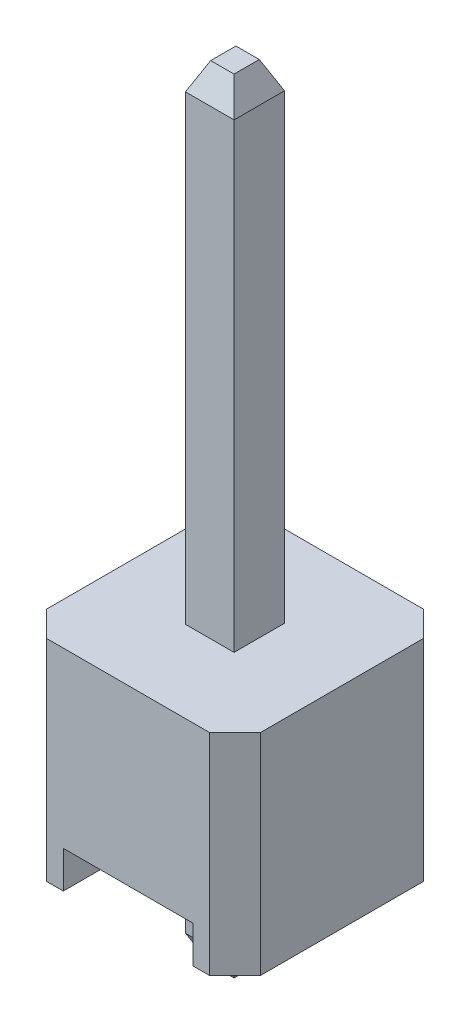
ISO-10303-21;
HEADER;
FILE_DESCRIPTION(('STEP AP214'),'2;1');
FILE_NAME('part.step','',(''),(''),'','','');
FILE_SCHEMA(('AUTOMOTIVE_DESIGN { 1 0 10303 214 1 1 1 1 }'));
ENDSEC;
DATA;
#1=APPLICATION_CONTEXT('core data for automotive mechanical design processes');
#2=APPLICATION_PROTOCOL_DEFINITION('international standard','automotive_design',2000,#1);
#3=PRODUCT_CONTEXT('',#1,'mechanical');
#4=PRODUCT('Part','Part','',(#3));
#5=PRODUCT_RELATED_PRODUCT_CATEGORY('part','',(#4));
#6=PRODUCT_DEFINITION_FORMATION('','',#4);
#7=PRODUCT_DEFINITION_CONTEXT('part definition',#1,'design');
#8=PRODUCT_DEFINITION('design','',#6,#7);
#9=PRODUCT_DEFINITION_SHAPE('','',#8);
#10=(LENGTH_UNIT() NAMED_UNIT(*) SI_UNIT(.MILLI.,.METRE.));
#11=(NAMED_UNIT(*) PLANE_ANGLE_UNIT() SI_UNIT($,.RADIAN.));
#12=(NAMED_UNIT(*) SI_UNIT($,.STERADIAN.) SOLID_ANGLE_UNIT());
#13=UNCERTAINTY_MEASURE_WITH_UNIT(LENGTH_MEASURE(1.E-05),#10,'distance_accuracy_value','');
#14=(GEOMETRIC_REPRESENTATION_CONTEXT(3) GLOBAL_UNCERTAINTY_ASSIGNED_CONTEXT((#13)) GLOBAL_UNIT_ASSIGNED_CONTEXT((#10,
#11,#12)) REPRESENTATION_CONTEXT('',''));
#15=CARTESIAN_POINT('',(0.,0.,0.));
#16=DIRECTION('',(0.,0.,1.));
#17=DIRECTION('',(1.,0.,0.));
#18=AXIS2_PLACEMENT_3D('',#15,#16,#17);
#19=CARTESIAN_POINT('',(-19.1812561045914,-5.69124998633488,0.951627111171994));
#20=DIRECTION('',(0.,-1.,0.));
#21=DIRECTION('',(0.,0.,-1.));
#22=AXIS2_PLACEMENT_3D('',#19,#20,#21);
#23=PLANE('',#22);
#24=DIRECTION('',(0.,0.,1.));
#25=VECTOR('',#24,1.);
#26=CARTESIAN_POINT('',(-19.0312561045914,-5.69124998633488,1.55162711117199));
#27=LINE('',#26,#25);
#28=CARTESIAN_POINT('',(-19.0312561045914,-5.69124998633488,1.40162711117199));
#29=VERTEX_POINT('',#28);
#30=CARTESIAN_POINT('',(-19.0312561045914,-5.69124998633488,1.10162711117199));
#31=VERTEX_POINT('',#30);
#32=EDGE_CURVE('E193',#29,#31,#27,.F.);
#33=ORIENTED_EDGE('',*,*,#32,.T.);
#34=DIRECTION('',(1.,0.,0.));
#35=VECTOR('',#34,1.);
#36=CARTESIAN_POINT('',(-19.1812561045914,-5.69124998633488,1.10162711117199));
#37=LINE('',#36,#35);
#38=CARTESIAN_POINT('',(-18.7537499744834,-5.69124998633488,1.10162711117199));
#39=VERTEX_POINT('',#38);
#40=EDGE_CURVE('E178',#31,#39,#37,.T.);
#41=ORIENTED_EDGE('',*,*,#40,.T.);
#42=DIRECTION('',(0.,0.,1.));
#43=VECTOR('',#42,1.);
#44=CARTESIAN_POINT('',(-18.7537499744834,-5.69124998633488,0.951627111171994));
#45=LINE('',#44,#43);
#46=CARTESIAN_POINT('',(-18.7537499744834,-5.69124998633488,1.40162711117199));
#47=VERTEX_POINT('',#46);
#48=EDGE_CURVE('E19',#39,#47,#45,.T.);
#49=ORIENTED_EDGE('',*,*,#48,.T.);
#50=DIRECTION('',(1.,0.,0.));
#51=VECTOR('',#50,1.);
#52=CARTESIAN_POINT('',(-18.6037499744834,-5.69124998633488,1.40162711117199));
#53=LINE('',#52,#51);
#54=EDGE_CURVE('E173',#47,#29,#53,.F.);
#55=ORIENTED_EDGE('',*,*,#54,.T.);
#56=EDGE_LOOP('',(#33,#41,#49,#55));
#57=FACE_BOUND('',#56,.T.);
#58=ADVANCED_FACE('F16',(#57),#23,.T.);
#59=CARTESIAN_POINT('',(-18.6037499744834,-5.36957394825845,0.951627111171994));
#60=DIRECTION('',(-0.90630778703665,0.4226182617407,0.));
#61=DIRECTION('',(-0.4226182617407,-0.90630778703665,0.));
#62=AXIS2_PLACEMENT_3D('',#59,#60,#61);
#63=PLANE('',#62);
#64=DIRECTION('',(0.,0.,-1.));
#65=VECTOR('',#64,1.);
#66=CARTESIAN_POINT('',(-18.6037499744834,-5.36957394825845,0.951627111171994));
#67=LINE('',#66,#65);
#68=CARTESIAN_POINT('',(-18.6037499744834,-5.36957394825845,1.55162711117199));
#69=VERTEX_POINT('',#68);
#70=CARTESIAN_POINT('',(-18.6037499744834,-5.36957394825845,0.951627111171994));
#71=VERTEX_POINT('',#70);
#72=EDGE_CURVE('E185',#69,#71,#67,.T.);
#73=ORIENTED_EDGE('',*,*,#72,.F.);
#74=DIRECTION('',(-0.389281620635035,-0.834817129478983,-0.389281620635025));
#75=VECTOR('',#74,1.);
#76=CARTESIAN_POINT('',(-18.6037499744834,-5.36957394825845,1.55162711117199));
#77=LINE('',#76,#75);
#78=EDGE_CURVE('E181',#69,#47,#77,.T.);
#79=ORIENTED_EDGE('',*,*,#78,.T.);
#80=ORIENTED_EDGE('',*,*,#48,.F.);
#81=DIRECTION('',(0.389281620635035,0.834817129478983,-0.389281620635025));
#82=VECTOR('',#81,1.);
#83=CARTESIAN_POINT('',(-18.7537499744834,-5.69124998633488,1.10162711117199));
#84=LINE('',#83,#82);
#85=EDGE_CURVE('E201',#39,#71,#84,.T.);
#86=ORIENTED_EDGE('',*,*,#85,.T.);
#87=EDGE_LOOP('',(#73,#79,#80,#86));
#88=FACE_BOUND('',#87,.T.);
#89=ADVANCED_FACE('F183',(#88),#63,.F.);
#90=CARTESIAN_POINT('',(-18.6037499744834,-5.36957394825845,1.55162711117199));
#91=DIRECTION('',(0.,0.422618261740701,-0.906307787036649));
#92=DIRECTION('',(0.,0.906307787036649,0.422618261740701));
#93=AXIS2_PLACEMENT_3D('',#90,#91,#92);
#94=PLANE('',#93);
#95=ORIENTED_EDGE('',*,*,#54,.F.);
#96=ORIENTED_EDGE('',*,*,#78,.F.);
#97=DIRECTION('',(1.,0.,0.));
#98=VECTOR('',#97,1.);
#99=CARTESIAN_POINT('',(-18.6037499744834,-5.36957394825845,1.55162711117199));
#100=LINE('',#99,#98);
#101=CARTESIAN_POINT('',(-19.1812561045914,-5.36957394825845,1.55162711117199));
#102=VERTEX_POINT('',#101);
#103=EDGE_CURVE('E204',#102,#69,#100,.T.);
#104=ORIENTED_EDGE('',*,*,#103,.F.);
#105=DIRECTION('',(0.389281620635027,-0.834817129478987,-0.389281620635025));
#106=VECTOR('',#105,1.);
#107=CARTESIAN_POINT('',(-19.1812561045914,-5.36957394825845,1.55162711117199));
#108=LINE('',#107,#106);
#109=EDGE_CURVE('E190',#102,#29,#108,.T.);
#110=ORIENTED_EDGE('',*,*,#109,.T.);
#111=EDGE_LOOP('',(#95,#96,#104,#110));
#112=FACE_BOUND('',#111,.T.);
#113=ADVANCED_FACE('F188',(#112),#94,.F.);
#114=CARTESIAN_POINT('',(-19.1812561045914,-5.36957394825845,1.55162711117199));
#115=DIRECTION('',(0.906307787036649,0.422618261740701,0.));
#116=DIRECTION('',(-0.422618261740701,0.906307787036649,0.));
#117=AXIS2_PLACEMENT_3D('',#114,#115,#116);
#118=PLANE('',#117);
#119=ORIENTED_EDGE('',*,*,#32,.F.);
#120=ORIENTED_EDGE('',*,*,#109,.F.);
#121=DIRECTION('',(0.,0.,1.));
#122=VECTOR('',#121,1.);
#123=CARTESIAN_POINT('',(-19.1812561045914,-5.36957394825845,1.55162711117199));
#124=LINE('',#123,#122);
#125=CARTESIAN_POINT('',(-19.1812561045914,-5.36957394825845,0.951627111171994));
#126=VERTEX_POINT('',#125);
#127=EDGE_CURVE('E210',#126,#102,#124,.T.);
#128=ORIENTED_EDGE('',*,*,#127,.F.);
#129=DIRECTION('',(0.389281620635027,-0.834817129478986,0.389281620635026));
#130=VECTOR('',#129,1.);
#131=CARTESIAN_POINT('',(-19.1812561045914,-5.36957394825845,0.951627111171994));
#132=LINE('',#131,#130);
#133=EDGE_CURVE('E197',#126,#31,#132,.T.);
#134=ORIENTED_EDGE('',*,*,#133,.T.);
#135=EDGE_LOOP('',(#119,#120,#128,#134));
#136=FACE_BOUND('',#135,.T.);
#137=ADVANCED_FACE('F517',(#136),#118,.F.);
#138=CARTESIAN_POINT('',(-19.1812561045914,-5.36957394825845,0.951627111171994));
#139=DIRECTION('',(0.,0.422618261740701,0.906307787036649));
#140=DIRECTION('',(0.,-0.906307787036649,0.422618261740701));
#141=AXIS2_PLACEMENT_3D('',#138,#139,#140);
#142=PLANE('',#141);
#143=ORIENTED_EDGE('',*,*,#40,.F.);
#144=ORIENTED_EDGE('',*,*,#133,.F.);
#145=DIRECTION('',(-1.,0.,0.));
#146=VECTOR('',#145,1.);
#147=CARTESIAN_POINT('',(-19.1812561045914,-5.36957394825845,0.951627111171994));
#148=LINE('',#147,#146);
#149=EDGE_CURVE('E219',#71,#126,#148,.T.);
#150=ORIENTED_EDGE('',*,*,#149,.F.);
#151=ORIENTED_EDGE('',*,*,#85,.F.);
#152=EDGE_LOOP('',(#143,#144,#150,#151));
#153=FACE_BOUND('',#152,.T.);
#154=ADVANCED_FACE('F513',(#153),#142,.F.);
#155=CARTESIAN_POINT('',(-18.6037499744834,-5.69124998633488,0.951627111171994));
#156=DIRECTION('',(1.,0.,0.));
#157=DIRECTION('',(0.,0.,-1.));
#158=AXIS2_PLACEMENT_3D('',#155,#156,#157);
#159=PLANE('',#158);
#160=DIRECTION('',(0.,1.,0.));
#161=VECTOR('',#160,1.);
#162=CARTESIAN_POINT('',(-18.6037499744834,-5.69124998633488,0.951627111171994));
#163=LINE('',#162,#161);
#164=CARTESIAN_POINT('',(-18.6037499744834,-4.25124998633488,0.951627111171994));
#165=VERTEX_POINT('',#164);
#166=EDGE_CURVE('E216',#165,#71,#163,.F.);
#167=ORIENTED_EDGE('',*,*,#166,.F.);
#168=DIRECTION('',(0.,0.,1.));
#169=VECTOR('',#168,1.);
#170=CARTESIAN_POINT('',(-18.6037499744834,-4.25124998633488,2.52162711117199));
#171=LINE('',#170,#169);
#172=CARTESIAN_POINT('',(-18.6037499744834,-4.25124998633488,1.55162711117199));
#173=VERTEX_POINT('',#172);
#174=EDGE_CURVE('E229',#165,#173,#171,.T.);
#175=ORIENTED_EDGE('',*,*,#174,.T.);
#176=DIRECTION('',(0.,1.,0.));
#177=VECTOR('',#176,1.);
#178=CARTESIAN_POINT('',(-18.6037499744834,-5.69124998633488,1.55162711117199));
#179=LINE('',#178,#177);
#180=EDGE_CURVE('E207',#69,#173,#179,.T.);
#181=ORIENTED_EDGE('',*,*,#180,.F.);
#182=ORIENTED_EDGE('',*,*,#72,.T.);
#183=EDGE_LOOP('',(#167,#175,#181,#182));
#184=FACE_BOUND('',#183,.T.);
#185=ADVANCED_FACE('F509',(#184),#159,.T.);
#186=CARTESIAN_POINT('',(-18.6037499744834,-5.69124998633488,1.55162711117199));
#187=DIRECTION('',(0.,0.,1.));
#188=DIRECTION('',(1.,0.,0.));
#189=AXIS2_PLACEMENT_3D('',#186,#187,#188);
#190=PLANE('',#189);
#191=ORIENTED_EDGE('',*,*,#180,.T.);
#192=DIRECTION('',(1.,0.,0.));
#193=VECTOR('',#192,1.);
#194=CARTESIAN_POINT('',(-18.1225030395374,-4.25124998633488,1.55162711117199));
#195=LINE('',#194,#193);
#196=CARTESIAN_POINT('',(-19.1812561045914,-4.25124998633488,1.55162711117199));
#197=VERTEX_POINT('',#196);
#198=EDGE_CURVE('E231',#173,#197,#195,.F.);
#199=ORIENTED_EDGE('',*,*,#198,.T.);
#200=DIRECTION('',(0.,1.,0.));
#201=VECTOR('',#200,1.);
#202=CARTESIAN_POINT('',(-19.1812561045914,-5.69124998633488,1.55162711117199));
#203=LINE('',#202,#201);
#204=EDGE_CURVE('E213',#102,#197,#203,.T.);
#205=ORIENTED_EDGE('',*,*,#204,.F.);
#206=ORIENTED_EDGE('',*,*,#103,.T.);
#207=EDGE_LOOP('',(#191,#199,#205,#206));
#208=FACE_BOUND('',#207,.T.);
#209=ADVANCED_FACE('F505',(#208),#190,.T.);
#210=CARTESIAN_POINT('',(-19.1812561045914,-5.69124998633488,1.55162711117199));
#211=DIRECTION('',(-1.,0.,0.));
#212=DIRECTION('',(0.,0.,1.));
#213=AXIS2_PLACEMENT_3D('',#210,#211,#212);
#214=PLANE('',#213);
#215=ORIENTED_EDGE('',*,*,#204,.T.);
#216=DIRECTION('',(0.,0.,1.));
#217=VECTOR('',#216,1.);
#218=CARTESIAN_POINT('',(-19.1812561045914,-4.25124998633488,2.52162711117199));
#219=LINE('',#218,#217);
#220=CARTESIAN_POINT('',(-19.1812561045914,-4.25124998633488,0.951627111171994));
#221=VERTEX_POINT('',#220);
#222=EDGE_CURVE('E233',#197,#221,#219,.F.);
#223=ORIENTED_EDGE('',*,*,#222,.T.);
#224=DIRECTION('',(0.,1.,0.));
#225=VECTOR('',#224,1.);
#226=CARTESIAN_POINT('',(-19.1812561045914,-5.69124998633488,0.951627111171994));
#227=LINE('',#226,#225);
#228=EDGE_CURVE('E222',#126,#221,#227,.T.);
#229=ORIENTED_EDGE('',*,*,#228,.F.);
#230=ORIENTED_EDGE('',*,*,#127,.T.);
#231=EDGE_LOOP('',(#215,#223,#229,#230));
#232=FACE_BOUND('',#231,.T.);
#233=ADVANCED_FACE('F501',(#232),#214,.T.);
#234=CARTESIAN_POINT('',(-19.1812561045914,-5.69124998633488,0.951627111171994));
#235=DIRECTION('',(0.,0.,-1.));
#236=DIRECTION('',(-1.,0.,0.));
#237=AXIS2_PLACEMENT_3D('',#234,#235,#236);
#238=PLANE('',#237);
#239=ORIENTED_EDGE('',*,*,#228,.T.);
#240=DIRECTION('',(1.,0.,0.));
#241=VECTOR('',#240,1.);
#242=CARTESIAN_POINT('',(-18.1225030395374,-4.25124998633488,0.951627111171994));
#243=LINE('',#242,#241);
#244=EDGE_CURVE('E235',#221,#165,#243,.T.);
#245=ORIENTED_EDGE('',*,*,#244,.T.);
#246=ORIENTED_EDGE('',*,*,#166,.T.);
#247=ORIENTED_EDGE('',*,*,#149,.T.);
#248=EDGE_LOOP('',(#239,#245,#246,#247));
#249=FACE_BOUND('',#248,.T.);
#250=ADVANCED_FACE('F497',(#249),#238,.T.);
#251=CARTESIAN_POINT('',(-18.1225030395374,-4.25124998633488,2.52162711117199));
#252=DIRECTION('',(0.,1.,0.));
#253=DIRECTION('',(0.,0.,1.));
#254=AXIS2_PLACEMENT_3D('',#251,#252,#253);
#255=PLANE('',#254);
#256=ORIENTED_EDGE('',*,*,#222,.F.);
#257=ORIENTED_EDGE('',*,*,#198,.F.);
#258=ORIENTED_EDGE('',*,*,#174,.F.);
#259=ORIENTED_EDGE('',*,*,#244,.F.);
#260=EDGE_LOOP('',(#256,#257,#258,#259));
#261=FACE_BOUND('',#260,.T.);
#262=DIRECTION('',(0.,0.,1.));
#263=VECTOR('',#262,1.);
#264=CARTESIAN_POINT('',(-19.6625030395374,-4.25124998633488,2.52162711117199));
#265=LINE('',#264,#263);
#266=CARTESIAN_POINT('',(-19.6625030395374,-4.25124998633488,2.52162711117199));
#267=VERTEX_POINT('',#266);
#268=CARTESIAN_POINT('',(-19.6625030395374,-4.25124998633488,-0.0183728888280069));
#269=VERTEX_POINT('',#268);
#270=EDGE_CURVE('E240',#267,#269,#265,.F.);
#271=ORIENTED_EDGE('',*,*,#270,.T.);
#272=DIRECTION('',(1.,0.,0.));
#273=VECTOR('',#272,1.);
#274=CARTESIAN_POINT('',(-18.1225030395374,-4.25124998633488,-0.0183728888280069));
#275=LINE('',#274,#273);
#276=CARTESIAN_POINT('',(-18.1225030395374,-4.25124998633488,-0.0183728888280069));
#277=VERTEX_POINT('',#276);
#278=EDGE_CURVE('E225',#277,#269,#275,.F.);
#279=ORIENTED_EDGE('',*,*,#278,.F.);
#280=DIRECTION('',(0.,0.,-1.));
#281=VECTOR('',#280,1.);
#282=CARTESIAN_POINT('',(-18.1225030395374,-4.25124998633488,2.52162711117199));
#283=LINE('',#282,#281);
#284=CARTESIAN_POINT('',(-18.1225030395374,-4.25124998633488,2.52162711117199));
#285=VERTEX_POINT('',#284);
#286=EDGE_CURVE('E247',#277,#285,#283,.F.);
#287=ORIENTED_EDGE('',*,*,#286,.T.);
#288=DIRECTION('',(1.,0.,0.));
#289=VECTOR('',#288,1.);
#290=CARTESIAN_POINT('',(-18.1225030395374,-4.25124998633488,2.52162711117199));
#291=LINE('',#290,#289);
#292=EDGE_CURVE('E227',#267,#285,#291,.T.);
#293=ORIENTED_EDGE('',*,*,#292,.F.);
#294=EDGE_LOOP('',(#271,#279,#287,#293));
#295=FACE_BOUND('',#294,.T.);
#296=ADVANCED_FACE('F494',(#261,#295),#255,.F.);
#297=CARTESIAN_POINT('',(-19.1812561045914,3.60875001366512,1.10162711117199));
#298=DIRECTION('',(0.,0.422618261740697,-0.906307787036651));
#299=DIRECTION('',(0.,0.906307787036651,0.422618261740697));
#300=AXIS2_PLACEMENT_3D('',#297,#298,#299);
#301=PLANE('',#300);
#302=DIRECTION('',(-0.389281620635024,-0.83481712947899,-0.389281620635022));
#303=VECTOR('',#302,1.);
#304=CARTESIAN_POINT('',(-19.0312561045914,3.60875001366512,1.10162711117199));
#305=LINE('',#304,#303);
#306=CARTESIAN_POINT('',(-19.0312561045914,3.60875001366512,1.10162711117199));
#307=VERTEX_POINT('',#306);
#308=CARTESIAN_POINT('',(-19.1812561045914,3.28707397558869,0.951627111171994));
#309=VERTEX_POINT('',#308);
#310=EDGE_CURVE('E262',#307,#309,#305,.T.);
#311=ORIENTED_EDGE('',*,*,#310,.F.);
#312=DIRECTION('',(1.,0.,0.));
#313=VECTOR('',#312,1.);
#314=CARTESIAN_POINT('',(-19.1812561045914,3.60875001366512,1.10162711117199));
#315=LINE('',#314,#313);
#316=CARTESIAN_POINT('',(-18.7537499744834,3.60875001366512,1.10162711117199));
#317=VERTEX_POINT('',#316);
#318=EDGE_CURVE('E255',#307,#317,#315,.T.);
#319=ORIENTED_EDGE('',*,*,#318,.T.);
#320=DIRECTION('',(-0.389281620635023,0.83481712947899,0.389281620635021));
#321=VECTOR('',#320,1.);
#322=CARTESIAN_POINT('',(-18.6037499744834,3.28707397558868,0.951627111171994));
#323=LINE('',#322,#321);
#324=CARTESIAN_POINT('',(-18.6037499744834,3.28707397558869,0.951627111171994));
#325=VERTEX_POINT('',#324);
#326=EDGE_CURVE('E252',#325,#317,#323,.T.);
#327=ORIENTED_EDGE('',*,*,#326,.F.);
#328=DIRECTION('',(-1.,0.,0.));
#329=VECTOR('',#328,1.);
#330=CARTESIAN_POINT('',(-19.1812561045914,3.28707397558869,0.951627111171994));
#331=LINE('',#330,#329);
#332=EDGE_CURVE('E265',#309,#325,#331,.F.);
#333=ORIENTED_EDGE('',*,*,#332,.F.);
#334=EDGE_LOOP('',(#311,#319,#327,#333));
#335=FACE_BOUND('',#334,.T.);
#336=ADVANCED_FACE('F471',(#335),#301,.T.);
#337=CARTESIAN_POINT('',(-19.6625030395374,-4.25124998633488,2.52162711117199));
#338=DIRECTION('',(-1.,0.,0.));
#339=DIRECTION('',(0.,0.,1.));
#340=AXIS2_PLACEMENT_3D('',#337,#338,#339);
#341=PLANE('',#340);
#342=DIRECTION('',(0.,1.,0.));
#343=VECTOR('',#342,1.);
#344=CARTESIAN_POINT('',(-19.6625030395374,-4.25124998633488,-0.0183728888280069));
#345=LINE('',#344,#343);
#346=CARTESIAN_POINT('',(-19.6625030395374,-4.69124998633488,-0.0183728888280069));
#347=VERTEX_POINT('',#346);
#348=EDGE_CURVE('E243',#269,#347,#345,.F.);
#349=ORIENTED_EDGE('',*,*,#348,.F.);
#350=ORIENTED_EDGE('',*,*,#270,.F.);
#351=DIRECTION('',(0.,1.,0.));
#352=VECTOR('',#351,1.);
#353=CARTESIAN_POINT('',(-19.6625030395374,-4.25124998633488,2.52162711117199));
#354=LINE('',#353,#352);
#355=CARTESIAN_POINT('',(-19.6625030395374,-4.69124998633488,2.52162711117199));
#356=VERTEX_POINT('',#355);
#357=EDGE_CURVE('E238',#356,#267,#354,.T.);
#358=ORIENTED_EDGE('',*,*,#357,.F.);
#359=DIRECTION('',(0.,0.,1.));
#360=VECTOR('',#359,1.);
#361=CARTESIAN_POINT('',(-19.6625030395374,-4.69124998633488,1.25162711117199));
#362=LINE('',#361,#360);
#363=EDGE_CURVE('E272',#356,#347,#362,.F.);
#364=ORIENTED_EDGE('',*,*,#363,.T.);
#365=EDGE_LOOP('',(#349,#350,#358,#364));
#366=FACE_BOUND('',#365,.T.);
#367=ADVANCED_FACE('F487',(#366),#341,.F.);
#368=CARTESIAN_POINT('',(-18.1225030395374,-4.25124998633488,2.52162711117199));
#369=DIRECTION('',(1.,0.,0.));
#370=DIRECTION('',(0.,0.,-1.));
#371=AXIS2_PLACEMENT_3D('',#368,#369,#370);
#372=PLANE('',#371);
#373=DIRECTION('',(0.,1.,0.));
#374=VECTOR('',#373,1.);
#375=CARTESIAN_POINT('',(-18.1225030395374,-4.25124998633488,2.52162711117199));
#376=LINE('',#375,#374);
#377=CARTESIAN_POINT('',(-18.1225030395374,-4.69124998633488,2.52162711117199));
#378=VERTEX_POINT('',#377);
#379=EDGE_CURVE('E250',#285,#378,#376,.F.);
#380=ORIENTED_EDGE('',*,*,#379,.F.);
#381=ORIENTED_EDGE('',*,*,#286,.F.);
#382=DIRECTION('',(0.,1.,0.));
#383=VECTOR('',#382,1.);
#384=CARTESIAN_POINT('',(-18.1225030395374,-4.25124998633488,-0.0183728888280069));
#385=LINE('',#384,#383);
#386=CARTESIAN_POINT('',(-18.1225030395374,-4.69124998633488,-0.018372888828007));
#387=VERTEX_POINT('',#386);
#388=EDGE_CURVE('E245',#387,#277,#385,.T.);
#389=ORIENTED_EDGE('',*,*,#388,.F.);
#390=DIRECTION('',(0.,0.,1.));
#391=VECTOR('',#390,1.);
#392=CARTESIAN_POINT('',(-18.1225030395374,-4.69124998633488,1.25162711117199));
#393=LINE('',#392,#391);
#394=EDGE_CURVE('E287',#387,#378,#393,.T.);
#395=ORIENTED_EDGE('',*,*,#394,.T.);
#396=EDGE_LOOP('',(#380,#381,#389,#395));
#397=FACE_BOUND('',#396,.T.);
#398=ADVANCED_FACE('F481',(#397),#372,.F.);
#399=CARTESIAN_POINT('',(-18.7537499744834,3.60875001366512,0.951627111171993));
#400=DIRECTION('',(0.906307787036651,0.422618261740697,0.));
#401=DIRECTION('',(-0.422618261740697,0.906307787036651,0.));
#402=AXIS2_PLACEMENT_3D('',#399,#400,#401);
#403=PLANE('',#402);
#404=ORIENTED_EDGE('',*,*,#326,.T.);
#405=DIRECTION('',(0.,0.,-1.));
#406=VECTOR('',#405,1.);
#407=CARTESIAN_POINT('',(-18.7537499744834,3.60875001366512,0.951627111171994));
#408=LINE('',#407,#406);
#409=CARTESIAN_POINT('',(-18.7537499744834,3.60875001366512,1.40162711117199));
#410=VERTEX_POINT('',#409);
#411=EDGE_CURVE('E257',#317,#410,#408,.F.);
#412=ORIENTED_EDGE('',*,*,#411,.T.);
#413=DIRECTION('',(-0.389281620635032,0.834817129478986,-0.389281620635021));
#414=VECTOR('',#413,1.);
#415=CARTESIAN_POINT('',(-18.6037499744834,3.28707397558869,1.55162711117199));
#416=LINE('',#415,#414);
#417=CARTESIAN_POINT('',(-18.6037499744834,3.28707397558869,1.55162711117199));
#418=VERTEX_POINT('',#417);
#419=EDGE_CURVE('E309',#418,#410,#416,.T.);
#420=ORIENTED_EDGE('',*,*,#419,.F.);
#421=DIRECTION('',(0.,0.,-1.));
#422=VECTOR('',#421,1.);
#423=CARTESIAN_POINT('',(-18.6037499744834,3.28707397558869,0.951627111171994));
#424=LINE('',#423,#422);
#425=EDGE_CURVE('E302',#325,#418,#424,.F.);
#426=ORIENTED_EDGE('',*,*,#425,.F.);
#427=EDGE_LOOP('',(#404,#412,#420,#426));
#428=FACE_BOUND('',#427,.T.);
#429=ADVANCED_FACE('F465',(#428),#403,.T.);
#430=CARTESIAN_POINT('',(-19.1812561045914,3.60875001366512,0.951627111171994));
#431=DIRECTION('',(0.,-1.,0.));
#432=DIRECTION('',(0.,0.,-1.));
#433=AXIS2_PLACEMENT_3D('',#430,#431,#432);
#434=PLANE('',#433);
#435=ORIENTED_EDGE('',*,*,#318,.F.);
#436=DIRECTION('',(0.,0.,1.));
#437=VECTOR('',#436,1.);
#438=CARTESIAN_POINT('',(-19.0312561045914,3.60875001366512,0.951627111171994));
#439=LINE('',#438,#437);
#440=CARTESIAN_POINT('',(-19.0312561045914,3.60875001366512,1.40162711117199));
#441=VERTEX_POINT('',#440);
#442=EDGE_CURVE('E259',#441,#307,#439,.F.);
#443=ORIENTED_EDGE('',*,*,#442,.F.);
#444=DIRECTION('',(1.,0.,0.));
#445=VECTOR('',#444,1.);
#446=CARTESIAN_POINT('',(-19.1812561045914,3.60875001366512,1.40162711117199));
#447=LINE('',#446,#445);
#448=EDGE_CURVE('E312',#410,#441,#447,.F.);
#449=ORIENTED_EDGE('',*,*,#448,.F.);
#450=ORIENTED_EDGE('',*,*,#411,.F.);
#451=EDGE_LOOP('',(#435,#443,#449,#450));
#452=FACE_BOUND('',#451,.T.);
#453=ADVANCED_FACE('F473',(#452),#434,.F.);
#454=CARTESIAN_POINT('',(-19.0312561045914,3.60875001366512,0.951627111171994));
#455=DIRECTION('',(-0.906307787036651,0.422618261740697,0.));
#456=DIRECTION('',(-0.422618261740697,-0.906307787036651,0.));
#457=AXIS2_PLACEMENT_3D('',#454,#455,#456);
#458=PLANE('',#457);
#459=ORIENTED_EDGE('',*,*,#310,.T.);
#460=DIRECTION('',(0.,0.,1.));
#461=VECTOR('',#460,1.);
#462=CARTESIAN_POINT('',(-19.1812561045914,3.28707397558869,1.55162711117199));
#463=LINE('',#462,#461);
#464=CARTESIAN_POINT('',(-19.1812561045914,3.28707397558869,1.55162711117199));
#465=VERTEX_POINT('',#464);
#466=EDGE_CURVE('E315',#465,#309,#463,.F.);
#467=ORIENTED_EDGE('',*,*,#466,.F.);
#468=DIRECTION('',(-0.389281620635025,-0.834817129478989,0.389281620635023));
#469=VECTOR('',#468,1.);
#470=CARTESIAN_POINT('',(-19.0312561045914,3.60875001366512,1.40162711117199));
#471=LINE('',#470,#469);
#472=EDGE_CURVE('E306',#441,#465,#471,.T.);
#473=ORIENTED_EDGE('',*,*,#472,.F.);
#474=ORIENTED_EDGE('',*,*,#442,.T.);
#475=EDGE_LOOP('',(#459,#467,#473,#474));
#476=FACE_BOUND('',#475,.T.);
#477=ADVANCED_FACE('F470',(#476),#458,.T.);
#478=CARTESIAN_POINT('',(-19.1812561045914,-5.69124998633488,0.951627111171994));
#479=DIRECTION('',(0.,0.,-1.));
#480=DIRECTION('',(-1.,0.,0.));
#481=AXIS2_PLACEMENT_3D('',#478,#479,#480);
#482=PLANE('',#481);
#483=DIRECTION('',(0.,1.,0.));
#484=VECTOR('',#483,1.);
#485=CARTESIAN_POINT('',(-18.6037499744834,-5.69124998633488,0.951627111171994));
#486=LINE('',#485,#484);
#487=CARTESIAN_POINT('',(-18.6037499744834,-2.19124998633488,0.951627111171994));
#488=VERTEX_POINT('',#487);
#489=EDGE_CURVE('E299',#488,#325,#486,.T.);
#490=ORIENTED_EDGE('',*,*,#489,.F.);
#491=DIRECTION('',(-1.,0.,0.));
#492=VECTOR('',#491,1.);
#493=CARTESIAN_POINT('',(-19.1812561045914,-2.19124998633488,0.951627111171994));
#494=LINE('',#493,#492);
#495=CARTESIAN_POINT('',(-19.1812561045914,-2.19124998633488,0.951627111171994));
#496=VERTEX_POINT('',#495);
#497=EDGE_CURVE('E268',#488,#496,#494,.T.);
#498=ORIENTED_EDGE('',*,*,#497,.T.);
#499=DIRECTION('',(0.,1.,0.));
#500=VECTOR('',#499,1.);
#501=CARTESIAN_POINT('',(-19.1812561045914,-5.69124998633488,0.951627111171994));
#502=LINE('',#501,#500);
#503=EDGE_CURVE('E318',#309,#496,#502,.F.);
#504=ORIENTED_EDGE('',*,*,#503,.F.);
#505=ORIENTED_EDGE('',*,*,#332,.T.);
#506=EDGE_LOOP('',(#490,#498,#504,#505));
#507=FACE_BOUND('',#506,.T.);
#508=ADVANCED_FACE('F461',(#507),#482,.T.);
#509=CARTESIAN_POINT('',(-21.1325030395374,-4.69124998633488,1.25162711117199));
#510=DIRECTION('',(0.,1.,0.));
#511=DIRECTION('',(0.,0.,1.));
#512=AXIS2_PLACEMENT_3D('',#509,#510,#511);
#513=PLANE('',#512);
#514=ORIENTED_EDGE('',*,*,#363,.F.);
#515=DIRECTION('',(1.,0.,0.));
#516=VECTOR('',#515,1.);
#517=CARTESIAN_POINT('',(-21.1325030395374,-4.69124998633488,2.52162711117199));
#518=LINE('',#517,#516);
#519=CARTESIAN_POINT('',(-19.8625030395374,-4.69124998633488,2.52162711117199));
#520=VERTEX_POINT('',#519);
#521=EDGE_CURVE('E270',#520,#356,#518,.T.);
#522=ORIENTED_EDGE('',*,*,#521,.F.);
#523=DIRECTION('',(-0.707106781186549,0.,-0.707106781186546));
#524=VECTOR('',#523,1.);
#525=CARTESIAN_POINT('',(-20.1625030395374,-4.69124998633488,2.22162711117199));
#526=LINE('',#525,#524);
#527=CARTESIAN_POINT('',(-20.1625030395374,-4.69124998633488,2.22162711117199));
#528=VERTEX_POINT('',#527);
#529=EDGE_CURVE('E279',#520,#528,#526,.T.);
#530=ORIENTED_EDGE('',*,*,#529,.T.);
#531=DIRECTION('',(0.,0.,-1.));
#532=VECTOR('',#531,1.);
#533=CARTESIAN_POINT('',(-20.1625030395374,-4.69124998633488,0.281627111171992));
#534=LINE('',#533,#532);
#535=CARTESIAN_POINT('',(-20.1625030395374,-4.69124998633488,0.281627111171992));
#536=VERTEX_POINT('',#535);
#537=EDGE_CURVE('E329',#528,#536,#534,.T.);
#538=ORIENTED_EDGE('',*,*,#537,.T.);
#539=DIRECTION('',(0.707106781186549,0.,-0.707106781186546));
#540=VECTOR('',#539,1.);
#541=CARTESIAN_POINT('',(-19.8625030395374,-4.69124998633488,-0.018372888828007));
#542=LINE('',#541,#540);
#543=CARTESIAN_POINT('',(-19.8625030395374,-4.69124998633488,-0.018372888828007));
#544=VERTEX_POINT('',#543);
#545=EDGE_CURVE('E296',#536,#544,#542,.T.);
#546=ORIENTED_EDGE('',*,*,#545,.T.);
#547=DIRECTION('',(1.,0.,0.));
#548=VECTOR('',#547,1.);
#549=CARTESIAN_POINT('',(-21.1325030395374,-4.69124998633488,-0.0183728888280071));
#550=LINE('',#549,#548);
#551=EDGE_CURVE('E275',#347,#544,#550,.F.);
#552=ORIENTED_EDGE('',*,*,#551,.F.);
#553=EDGE_LOOP('',(#514,#522,#530,#538,#546,#552));
#554=FACE_BOUND('',#553,.T.);
#555=ADVANCED_FACE('F633',(#554),#513,.F.);
#556=CARTESIAN_POINT('',(-20.1625030395374,-2.19124998633488,2.22162711117199));
#557=DIRECTION('',(0.707106781186546,0.,-0.707106781186549));
#558=DIRECTION('',(-0.707106781186549,0.,-0.707106781186546));
#559=AXIS2_PLACEMENT_3D('',#556,#557,#558);
#560=PLANE('',#559);
#561=DIRECTION('',(0.,1.,0.));
#562=VECTOR('',#561,1.);
#563=CARTESIAN_POINT('',(-19.8625030395374,-2.19124998633488,2.52162711117199));
#564=LINE('',#563,#562);
#565=CARTESIAN_POINT('',(-19.8625030395374,-2.19124998633488,2.52162711117199));
#566=VERTEX_POINT('',#565);
#567=EDGE_CURVE('E332',#520,#566,#564,.T.);
#568=ORIENTED_EDGE('',*,*,#567,.T.);
#569=DIRECTION('',(-0.707106781186549,0.,-0.707106781186546));
#570=VECTOR('',#569,1.);
#571=CARTESIAN_POINT('',(-20.1625030395374,-2.19124998633488,2.22162711117199));
#572=LINE('',#571,#570);
#573=CARTESIAN_POINT('',(-20.1625030395374,-2.19124998633488,2.22162711117199));
#574=VERTEX_POINT('',#573);
#575=EDGE_CURVE('E277',#574,#566,#572,.F.);
#576=ORIENTED_EDGE('',*,*,#575,.F.);
#577=DIRECTION('',(0.,1.,0.));
#578=VECTOR('',#577,1.);
#579=CARTESIAN_POINT('',(-20.1625030395374,-2.19124998633488,2.22162711117199));
#580=LINE('',#579,#578);
#581=EDGE_CURVE('E326',#574,#528,#580,.F.);
#582=ORIENTED_EDGE('',*,*,#581,.T.);
#583=ORIENTED_EDGE('',*,*,#529,.F.);
#584=EDGE_LOOP('',(#568,#576,#582,#583));
#585=FACE_BOUND('',#584,.T.);
#586=ADVANCED_FACE('F394',(#585),#560,.F.);
#587=CARTESIAN_POINT('',(-17.9225030395374,-2.19124998633488,2.52162711117199));
#588=DIRECTION('',(-0.707106781186549,0.,-0.707106781186546));
#589=DIRECTION('',(-0.707106781186546,0.,0.707106781186549));
#590=AXIS2_PLACEMENT_3D('',#587,#588,#589);
#591=PLANE('',#590);
#592=DIRECTION('',(0.,1.,0.));
#593=VECTOR('',#592,1.);
#594=CARTESIAN_POINT('',(-17.6225030395374,-2.19124998633488,2.22162711117199));
#595=LINE('',#594,#593);
#596=CARTESIAN_POINT('',(-17.6225030395374,-4.69124998633488,2.22162711117199));
#597=VERTEX_POINT('',#596);
#598=CARTESIAN_POINT('',(-17.6225030395374,-2.19124998633488,2.22162711117199));
#599=VERTEX_POINT('',#598);
#600=EDGE_CURVE('E340',#597,#599,#595,.T.);
#601=ORIENTED_EDGE('',*,*,#600,.T.);
#602=DIRECTION('',(-0.707106781186546,0.,0.707106781186549));
#603=VECTOR('',#602,1.);
#604=CARTESIAN_POINT('',(-17.9225030395374,-2.19124998633488,2.52162711117199));
#605=LINE('',#604,#603);
#606=CARTESIAN_POINT('',(-17.9225030395374,-2.19124998633488,2.52162711117199));
#607=VERTEX_POINT('',#606);
#608=EDGE_CURVE('E281',#607,#599,#605,.F.);
#609=ORIENTED_EDGE('',*,*,#608,.F.);
#610=DIRECTION('',(0.,1.,0.));
#611=VECTOR('',#610,1.);
#612=CARTESIAN_POINT('',(-17.9225030395374,-2.19124998633488,2.52162711117199));
#613=LINE('',#612,#611);
#614=CARTESIAN_POINT('',(-17.9225030395374,-4.69124998633488,2.52162711117199));
#615=VERTEX_POINT('',#614);
#616=EDGE_CURVE('E335',#607,#615,#613,.F.);
#617=ORIENTED_EDGE('',*,*,#616,.T.);
#618=DIRECTION('',(0.707106781186545,0.,-0.70710678118655));
#619=VECTOR('',#618,1.);
#620=CARTESIAN_POINT('',(-17.9225030395374,-4.69124998633488,2.52162711117199));
#621=LINE('',#620,#619);
#622=EDGE_CURVE('E283',#615,#597,#621,.T.);
#623=ORIENTED_EDGE('',*,*,#622,.T.);
#624=EDGE_LOOP('',(#601,#609,#617,#623));
#625=FACE_BOUND('',#624,.T.);
#626=ADVANCED_FACE('F401',(#625),#591,.F.);
#627=CARTESIAN_POINT('',(-21.1325030395374,-4.69124998633488,1.25162711117199));
#628=DIRECTION('',(0.,1.,0.));
#629=DIRECTION('',(0.,0.,1.));
#630=AXIS2_PLACEMENT_3D('',#627,#628,#629);
#631=PLANE('',#630);
#632=ORIENTED_EDGE('',*,*,#394,.F.);
#633=DIRECTION('',(1.,0.,0.));
#634=VECTOR('',#633,1.);
#635=CARTESIAN_POINT('',(-21.1325030395374,-4.69124998633488,-0.0183728888280071));
#636=LINE('',#635,#634);
#637=CARTESIAN_POINT('',(-17.9225030395374,-4.69124998633488,-0.0183728888280068));
#638=VERTEX_POINT('',#637);
#639=EDGE_CURVE('E285',#638,#387,#636,.F.);
#640=ORIENTED_EDGE('',*,*,#639,.F.);
#641=DIRECTION('',(0.707106781186547,0.,0.707106781186548));
#642=VECTOR('',#641,1.);
#643=CARTESIAN_POINT('',(-17.6225030395374,-4.69124998633488,0.281627111171993));
#644=LINE('',#643,#642);
#645=CARTESIAN_POINT('',(-17.6225030395374,-4.69124998633488,0.281627111171993));
#646=VERTEX_POINT('',#645);
#647=EDGE_CURVE('E292',#638,#646,#644,.T.);
#648=ORIENTED_EDGE('',*,*,#647,.T.);
#649=DIRECTION('',(0.,0.,1.));
#650=VECTOR('',#649,1.);
#651=CARTESIAN_POINT('',(-17.6225030395374,-4.69124998633488,2.22162711117199));
#652=LINE('',#651,#650);
#653=EDGE_CURVE('E346',#646,#597,#652,.T.);
#654=ORIENTED_EDGE('',*,*,#653,.T.);
#655=ORIENTED_EDGE('',*,*,#622,.F.);
#656=DIRECTION('',(-1.,0.,0.));
#657=VECTOR('',#656,1.);
#658=CARTESIAN_POINT('',(-19.8625030395374,-4.69124998633488,2.52162711117199));
#659=LINE('',#658,#657);
#660=EDGE_CURVE('E337',#615,#378,#659,.T.);
#661=ORIENTED_EDGE('',*,*,#660,.T.);
#662=EDGE_LOOP('',(#632,#640,#648,#654,#655,#661));
#663=FACE_BOUND('',#662,.T.);
#664=ADVANCED_FACE('F404',(#663),#631,.F.);
#665=CARTESIAN_POINT('',(-17.6225030395374,-2.19124998633488,0.281627111171993));
#666=DIRECTION('',(-0.707106781186548,0.,0.707106781186547));
#667=DIRECTION('',(0.707106781186547,0.,0.707106781186548));
#668=AXIS2_PLACEMENT_3D('',#665,#666,#667);
#669=PLANE('',#668);
#670=DIRECTION('',(0.,1.,0.));
#671=VECTOR('',#670,1.);
#672=CARTESIAN_POINT('',(-17.9225030395374,-2.19124998633488,-0.018372888828007));
#673=LINE('',#672,#671);
#674=CARTESIAN_POINT('',(-17.9225030395374,-2.19124998633488,-0.0183728888280066));
#675=VERTEX_POINT('',#674);
#676=EDGE_CURVE('E349',#638,#675,#673,.T.);
#677=ORIENTED_EDGE('',*,*,#676,.T.);
#678=DIRECTION('',(0.707106781186547,0.,0.707106781186548));
#679=VECTOR('',#678,1.);
#680=CARTESIAN_POINT('',(-17.6225030395374,-2.19124998633488,0.281627111171993));
#681=LINE('',#680,#679);
#682=CARTESIAN_POINT('',(-17.6225030395374,-2.19124998633488,0.281627111171993));
#683=VERTEX_POINT('',#682);
#684=EDGE_CURVE('E290',#683,#675,#681,.F.);
#685=ORIENTED_EDGE('',*,*,#684,.F.);
#686=DIRECTION('',(0.,1.,0.));
#687=VECTOR('',#686,1.);
#688=CARTESIAN_POINT('',(-17.6225030395374,-2.19124998633488,0.281627111171993));
#689=LINE('',#688,#687);
#690=EDGE_CURVE('E343',#683,#646,#689,.F.);
#691=ORIENTED_EDGE('',*,*,#690,.T.);
#692=ORIENTED_EDGE('',*,*,#647,.F.);
#693=EDGE_LOOP('',(#677,#685,#691,#692));
#694=FACE_BOUND('',#693,.T.);
#695=ADVANCED_FACE('F413',(#694),#669,.F.);
#696=CARTESIAN_POINT('',(-19.8625030395374,-2.19124998633488,-0.018372888828007));
#697=DIRECTION('',(0.707106781186546,0.,0.707106781186549));
#698=DIRECTION('',(0.707106781186549,0.,-0.707106781186546));
#699=AXIS2_PLACEMENT_3D('',#696,#697,#698);
#700=PLANE('',#699);
#701=DIRECTION('',(0.,1.,0.));
#702=VECTOR('',#701,1.);
#703=CARTESIAN_POINT('',(-20.1625030395374,-2.19124998633488,0.281627111171992));
#704=LINE('',#703,#702);
#705=CARTESIAN_POINT('',(-20.1625030395374,-2.19124998633488,0.281627111171992));
#706=VERTEX_POINT('',#705);
#707=EDGE_CURVE('E323',#536,#706,#704,.T.);
#708=ORIENTED_EDGE('',*,*,#707,.T.);
#709=DIRECTION('',(0.707106781186549,0.,-0.707106781186546));
#710=VECTOR('',#709,1.);
#711=CARTESIAN_POINT('',(-19.8625030395374,-2.19124998633488,-0.018372888828007));
#712=LINE('',#711,#710);
#713=CARTESIAN_POINT('',(-19.8625030395374,-2.19124998633488,-0.018372888828007));
#714=VERTEX_POINT('',#713);
#715=EDGE_CURVE('E294',#714,#706,#712,.F.);
#716=ORIENTED_EDGE('',*,*,#715,.F.);
#717=DIRECTION('',(0.,1.,0.));
#718=VECTOR('',#717,1.);
#719=CARTESIAN_POINT('',(-19.8625030395374,-2.19124998633488,-0.018372888828007));
#720=LINE('',#719,#718);
#721=EDGE_CURVE('E352',#714,#544,#720,.F.);
#722=ORIENTED_EDGE('',*,*,#721,.T.);
#723=ORIENTED_EDGE('',*,*,#545,.F.);
#724=EDGE_LOOP('',(#708,#716,#722,#723));
#725=FACE_BOUND('',#724,.T.);
#726=ADVANCED_FACE('F383',(#725),#700,.F.);
#727=CARTESIAN_POINT('',(-18.6037499744834,-5.69124998633488,0.951627111171994));
#728=DIRECTION('',(1.,0.,0.));
#729=DIRECTION('',(0.,0.,-1.));
#730=AXIS2_PLACEMENT_3D('',#727,#728,#729);
#731=PLANE('',#730);
#732=DIRECTION('',(0.,1.,0.));
#733=VECTOR('',#732,1.);
#734=CARTESIAN_POINT('',(-18.6037499744834,-5.69124998633488,1.55162711117199));
#735=LINE('',#734,#733);
#736=CARTESIAN_POINT('',(-18.6037499744834,-2.19124998633488,1.55162711117199));
#737=VERTEX_POINT('',#736);
#738=EDGE_CURVE('E355',#737,#418,#735,.T.);
#739=ORIENTED_EDGE('',*,*,#738,.F.);
#740=DIRECTION('',(0.,0.,-1.));
#741=VECTOR('',#740,1.);
#742=CARTESIAN_POINT('',(-18.6037499744834,-2.19124998633488,0.951627111171994));
#743=LINE('',#742,#741);
#744=EDGE_CURVE('E33',#737,#488,#743,.T.);
#745=ORIENTED_EDGE('',*,*,#744,.T.);
#746=ORIENTED_EDGE('',*,*,#489,.T.);
#747=ORIENTED_EDGE('',*,*,#425,.T.);
#748=EDGE_LOOP('',(#739,#745,#746,#747));
#749=FACE_BOUND('',#748,.T.);
#750=ADVANCED_FACE('F421',(#749),#731,.T.);
#751=CARTESIAN_POINT('',(-19.1812561045914,3.60875001366512,1.40162711117199));
#752=DIRECTION('',(0.,0.422618261740697,0.906307787036651));
#753=DIRECTION('',(0.,-0.906307787036651,0.422618261740697));
#754=AXIS2_PLACEMENT_3D('',#751,#752,#753);
#755=PLANE('',#754);
#756=ORIENTED_EDGE('',*,*,#419,.T.);
#757=ORIENTED_EDGE('',*,*,#448,.T.);
#758=ORIENTED_EDGE('',*,*,#472,.T.);
#759=DIRECTION('',(1.,0.,0.));
#760=VECTOR('',#759,1.);
#761=CARTESIAN_POINT('',(-18.6037499744834,3.28707397558869,1.55162711117199));
#762=LINE('',#761,#760);
#763=EDGE_CURVE('E358',#418,#465,#762,.F.);
#764=ORIENTED_EDGE('',*,*,#763,.F.);
#765=EDGE_LOOP('',(#756,#757,#758,#764));
#766=FACE_BOUND('',#765,.T.);
#767=ADVANCED_FACE('F444',(#766),#755,.T.);
#768=CARTESIAN_POINT('',(-19.1812561045914,-5.69124998633488,1.55162711117199));
#769=DIRECTION('',(-1.,0.,0.));
#770=DIRECTION('',(0.,0.,1.));
#771=AXIS2_PLACEMENT_3D('',#768,#769,#770);
#772=PLANE('',#771);
#773=ORIENTED_EDGE('',*,*,#503,.T.);
#774=DIRECTION('',(0.,0.,1.));
#775=VECTOR('',#774,1.);
#776=CARTESIAN_POINT('',(-19.1812561045914,-2.19124998633488,1.55162711117199));
#777=LINE('',#776,#775);
#778=CARTESIAN_POINT('',(-19.1812561045914,-2.19124998633488,1.55162711117199));
#779=VERTEX_POINT('',#778);
#780=EDGE_CURVE('E321',#496,#779,#777,.T.);
#781=ORIENTED_EDGE('',*,*,#780,.T.);
#782=DIRECTION('',(0.,1.,0.));
#783=VECTOR('',#782,1.);
#784=CARTESIAN_POINT('',(-19.1812561045914,-5.69124998633488,1.55162711117199));
#785=LINE('',#784,#783);
#786=EDGE_CURVE('E361',#465,#779,#785,.F.);
#787=ORIENTED_EDGE('',*,*,#786,.F.);
#788=ORIENTED_EDGE('',*,*,#466,.T.);
#789=EDGE_LOOP('',(#773,#781,#787,#788));
#790=FACE_BOUND('',#789,.T.);
#791=ADVANCED_FACE('F441',(#790),#772,.T.);
#792=CARTESIAN_POINT('',(-20.1625030395374,-2.19124998633488,0.281627111171992));
#793=DIRECTION('',(1.,0.,0.));
#794=DIRECTION('',(0.,0.,-1.));
#795=AXIS2_PLACEMENT_3D('',#792,#793,#794);
#796=PLANE('',#795);
#797=ORIENTED_EDGE('',*,*,#581,.F.);
#798=DIRECTION('',(0.,0.,1.));
#799=VECTOR('',#798,1.);
#800=CARTESIAN_POINT('',(-20.1625030395374,-2.19124998633488,1.25162711117199));
#801=LINE('',#800,#799);
#802=EDGE_CURVE('E364',#706,#574,#801,.T.);
#803=ORIENTED_EDGE('',*,*,#802,.F.);
#804=ORIENTED_EDGE('',*,*,#707,.F.);
#805=ORIENTED_EDGE('',*,*,#537,.F.);
#806=EDGE_LOOP('',(#797,#803,#804,#805));
#807=FACE_BOUND('',#806,.T.);
#808=ADVANCED_FACE('F389',(#807),#796,.F.);
#809=CARTESIAN_POINT('',(-19.8625030395374,-2.19124998633488,2.52162711117199));
#810=DIRECTION('',(0.,0.,-1.));
#811=DIRECTION('',(-1.,0.,0.));
#812=AXIS2_PLACEMENT_3D('',#809,#810,#811);
#813=PLANE('',#812);
#814=ORIENTED_EDGE('',*,*,#379,.T.);
#815=ORIENTED_EDGE('',*,*,#660,.F.);
#816=ORIENTED_EDGE('',*,*,#616,.F.);
#817=DIRECTION('',(1.,0.,0.));
#818=VECTOR('',#817,1.);
#819=CARTESIAN_POINT('',(-21.1325030395374,-2.19124998633488,2.52162711117199));
#820=LINE('',#819,#818);
#821=EDGE_CURVE('E367',#566,#607,#820,.T.);
#822=ORIENTED_EDGE('',*,*,#821,.F.);
#823=ORIENTED_EDGE('',*,*,#567,.F.);
#824=ORIENTED_EDGE('',*,*,#521,.T.);
#825=ORIENTED_EDGE('',*,*,#357,.T.);
#826=ORIENTED_EDGE('',*,*,#292,.T.);
#827=EDGE_LOOP('',(#814,#815,#816,#822,#823,#824,#825,#826));
#828=FACE_BOUND('',#827,.T.);
#829=ADVANCED_FACE('F397',(#828),#813,.F.);
#830=CARTESIAN_POINT('',(-17.6225030395374,-2.19124998633488,2.22162711117199));
#831=DIRECTION('',(-1.,0.,0.));
#832=DIRECTION('',(0.,0.,1.));
#833=AXIS2_PLACEMENT_3D('',#830,#831,#832);
#834=PLANE('',#833);
#835=ORIENTED_EDGE('',*,*,#690,.F.);
#836=DIRECTION('',(0.,0.,1.));
#837=VECTOR('',#836,1.);
#838=CARTESIAN_POINT('',(-17.6225030395374,-2.19124998633488,1.25162711117199));
#839=LINE('',#838,#837);
#840=EDGE_CURVE('E370',#599,#683,#839,.F.);
#841=ORIENTED_EDGE('',*,*,#840,.F.);
#842=ORIENTED_EDGE('',*,*,#600,.F.);
#843=ORIENTED_EDGE('',*,*,#653,.F.);
#844=EDGE_LOOP('',(#835,#841,#842,#843));
#845=FACE_BOUND('',#844,.T.);
#846=ADVANCED_FACE('F411',(#845),#834,.F.);
#847=CARTESIAN_POINT('',(-17.9225030395374,-2.19124998633488,-0.018372888828007));
#848=DIRECTION('',(0.,0.,1.));
#849=DIRECTION('',(1.,0.,0.));
#850=AXIS2_PLACEMENT_3D('',#847,#848,#849);
#851=PLANE('',#850);
#852=ORIENTED_EDGE('',*,*,#388,.T.);
#853=ORIENTED_EDGE('',*,*,#278,.T.);
#854=ORIENTED_EDGE('',*,*,#348,.T.);
#855=ORIENTED_EDGE('',*,*,#551,.T.);
#856=ORIENTED_EDGE('',*,*,#721,.F.);
#857=DIRECTION('',(1.,0.,0.));
#858=VECTOR('',#857,1.);
#859=CARTESIAN_POINT('',(-21.1325030395374,-2.19124998633488,-0.0183728888280071));
#860=LINE('',#859,#858);
#861=EDGE_CURVE('E25',#675,#714,#860,.F.);
#862=ORIENTED_EDGE('',*,*,#861,.F.);
#863=ORIENTED_EDGE('',*,*,#676,.F.);
#864=ORIENTED_EDGE('',*,*,#639,.T.);
#865=EDGE_LOOP('',(#852,#853,#854,#855,#856,#862,#863,#864));
#866=FACE_BOUND('',#865,.T.);
#867=ADVANCED_FACE('F380',(#866),#851,.F.);
#868=CARTESIAN_POINT('',(-18.6037499744834,-5.69124998633488,1.55162711117199));
#869=DIRECTION('',(0.,0.,1.));
#870=DIRECTION('',(1.,0.,0.));
#871=AXIS2_PLACEMENT_3D('',#868,#869,#870);
#872=PLANE('',#871);
#873=ORIENTED_EDGE('',*,*,#786,.T.);
#874=DIRECTION('',(1.,0.,0.));
#875=VECTOR('',#874,1.);
#876=CARTESIAN_POINT('',(-21.1325030395374,-2.19124998633488,1.55162711117199));
#877=LINE('',#876,#875);
#878=EDGE_CURVE('E11',#737,#779,#877,.F.);
#879=ORIENTED_EDGE('',*,*,#878,.F.);
#880=ORIENTED_EDGE('',*,*,#738,.T.);
#881=ORIENTED_EDGE('',*,*,#763,.T.);
#882=EDGE_LOOP('',(#873,#879,#880,#881));
#883=FACE_BOUND('',#882,.T.);
#884=ADVANCED_FACE('F425',(#883),#872,.T.);
#885=CARTESIAN_POINT('',(-21.1325030395374,-2.19124998633488,1.25162711117199));
#886=DIRECTION('',(0.,1.,0.));
#887=DIRECTION('',(0.,0.,1.));
#888=AXIS2_PLACEMENT_3D('',#885,#886,#887);
#889=PLANE('',#888);
#890=ORIENTED_EDGE('',*,*,#744,.F.);
#891=ORIENTED_EDGE('',*,*,#878,.T.);
#892=ORIENTED_EDGE('',*,*,#780,.F.);
#893=ORIENTED_EDGE('',*,*,#497,.F.);
#894=EDGE_LOOP('',(#890,#891,#892,#893));
#895=FACE_BOUND('',#894,.T.);
#896=ORIENTED_EDGE('',*,*,#684,.T.);
#897=ORIENTED_EDGE('',*,*,#861,.T.);
#898=ORIENTED_EDGE('',*,*,#715,.T.);
#899=ORIENTED_EDGE('',*,*,#802,.T.);
#900=ORIENTED_EDGE('',*,*,#575,.T.);
#901=ORIENTED_EDGE('',*,*,#821,.T.);
#902=ORIENTED_EDGE('',*,*,#608,.T.);
#903=ORIENTED_EDGE('',*,*,#840,.T.);
#904=EDGE_LOOP('',(#896,#897,#898,#899,#900,#901,#902,#903));
#905=FACE_BOUND('',#904,.T.);
#906=ADVANCED_FACE('F376',(#895,#905),#889,.T.);
#907=CLOSED_SHELL('',(#58,#89,#113,#137,#154,#185,#209,#233,#250,#296,#336,#367,#398,#429,#453,
#477,#508,#555,#586,#626,#664,#695,#726,#750,#767,#791,#808,#829,#846,#867,#884,#906));
#908=MANIFOLD_SOLID_BREP('B1',#907);
#909=ADVANCED_BREP_SHAPE_REPRESENTATION('',(#18,#908),#14);
#910=SHAPE_DEFINITION_REPRESENTATION(#9,#909);
ENDSEC;
END-ISO-10303-21;
